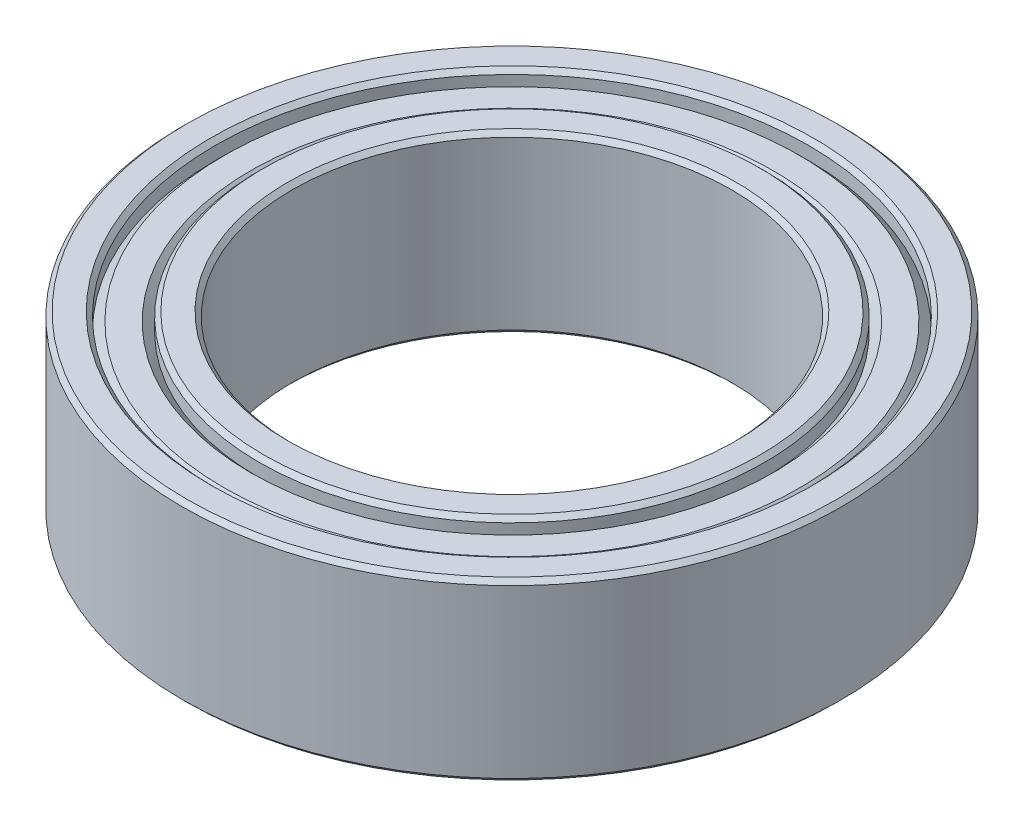
ISO-10303-21;
HEADER;
FILE_DESCRIPTION(('STEP AP214'),'2;1');
FILE_NAME('part.step','',(''),(''),'','','');
FILE_SCHEMA(('AUTOMOTIVE_DESIGN { 1 0 10303 214 1 1 1 1 }'));
ENDSEC;
DATA;
#1=APPLICATION_CONTEXT('core data for automotive mechanical design processes');
#2=APPLICATION_PROTOCOL_DEFINITION('international standard','automotive_design',2000,#1);
#3=PRODUCT_CONTEXT('',#1,'mechanical');
#4=PRODUCT('Part','Part','',(#3));
#5=PRODUCT_RELATED_PRODUCT_CATEGORY('part','',(#4));
#6=PRODUCT_DEFINITION_FORMATION('','',#4);
#7=PRODUCT_DEFINITION_CONTEXT('part definition',#1,'design');
#8=PRODUCT_DEFINITION('design','',#6,#7);
#9=PRODUCT_DEFINITION_SHAPE('','',#8);
#10=(LENGTH_UNIT() NAMED_UNIT(*) SI_UNIT(.MILLI.,.METRE.));
#11=(NAMED_UNIT(*) PLANE_ANGLE_UNIT() SI_UNIT($,.RADIAN.));
#12=(NAMED_UNIT(*) SI_UNIT($,.STERADIAN.) SOLID_ANGLE_UNIT());
#13=UNCERTAINTY_MEASURE_WITH_UNIT(LENGTH_MEASURE(1.E-05),#10,'distance_accuracy_value','');
#14=(GEOMETRIC_REPRESENTATION_CONTEXT(3) GLOBAL_UNCERTAINTY_ASSIGNED_CONTEXT((#13)) GLOBAL_UNIT_ASSIGNED_CONTEXT((#10,
#11,#12)) REPRESENTATION_CONTEXT('',''));
#15=CARTESIAN_POINT('',(0.,0.,0.));
#16=DIRECTION('',(0.,0.,1.));
#17=DIRECTION('',(1.,0.,0.));
#18=AXIS2_PLACEMENT_3D('',#15,#16,#17);
#19=CARTESIAN_POINT('',(0.,-2.,0.));
#20=DIRECTION('',(0.,1.,0.));
#21=DIRECTION('',(0.,0.,1.));
#22=AXIS2_PLACEMENT_3D('',#19,#20,#21);
#23=PLANE('',#22);
#24=CARTESIAN_POINT('',(0.,-2.,0.));
#25=DIRECTION('',(0.,1.,0.));
#26=DIRECTION('',(0.,0.,1.));
#27=AXIS2_PLACEMENT_3D('',#24,#25,#26);
#28=CIRCLE('',#27,6.85);
#29=CARTESIAN_POINT('',(0.,-2.,6.85));
#30=VERTEX_POINT('',#29);
#31=EDGE_CURVE('E61',#30,#30,#28,.T.);
#32=ORIENTED_EDGE('',*,*,#31,.T.);
#33=EDGE_LOOP('',(#32));
#34=FACE_BOUND('',#33,.T.);
#35=CARTESIAN_POINT('',(0.,-2.,0.));
#36=DIRECTION('',(0.,1.,0.));
#37=DIRECTION('',(0.,0.,1.));
#38=AXIS2_PLACEMENT_3D('',#35,#36,#37);
#39=CIRCLE('',#38,7.4);
#40=CARTESIAN_POINT('',(0.,-2.,7.4));
#41=VERTEX_POINT('',#40);
#42=EDGE_CURVE('E64',#41,#41,#39,.F.);
#43=ORIENTED_EDGE('',*,*,#42,.T.);
#44=EDGE_LOOP('',(#43));
#45=FACE_BOUND('',#44,.T.);
#46=ADVANCED_FACE('F35',(#34,#45),#23,.F.);
#47=CARTESIAN_POINT('',(0.,-2.,0.));
#48=DIRECTION('',(0.,1.,0.));
#49=DIRECTION('',(0.,0.,1.));
#50=AXIS2_PLACEMENT_3D('',#47,#48,#49);
#51=CIRCLE('',#50,5.1);
#52=CARTESIAN_POINT('',(0.,-2.,5.1));
#53=VERTEX_POINT('',#52);
#54=EDGE_CURVE('E85',#53,#53,#51,.T.);
#55=ORIENTED_EDGE('',*,*,#54,.T.);
#56=EDGE_LOOP('',(#55));
#57=FACE_BOUND('',#56,.T.);
#58=CARTESIAN_POINT('',(0.,-2.,0.));
#59=DIRECTION('',(0.,1.,0.));
#60=DIRECTION('',(0.,0.,1.));
#61=AXIS2_PLACEMENT_3D('',#58,#59,#60);
#62=CIRCLE('',#61,5.64999999999999);
#63=CARTESIAN_POINT('',(0.,-2.,5.64999999999999));
#64=VERTEX_POINT('',#63);
#65=EDGE_CURVE('E88',#64,#64,#62,.F.);
#66=ORIENTED_EDGE('',*,*,#65,.T.);
#67=EDGE_LOOP('',(#66));
#68=FACE_BOUND('',#67,.T.);
#69=ADVANCED_FACE('F142',(#57,#68),#23,.F.);
#70=CARTESIAN_POINT('',(0.,2.,0.));
#71=DIRECTION('',(0.,1.,0.));
#72=DIRECTION('',(0.,0.,1.));
#73=AXIS2_PLACEMENT_3D('',#70,#71,#72);
#74=PLANE('',#73);
#75=CARTESIAN_POINT('',(0.,2.,0.));
#76=DIRECTION('',(0.,1.,0.));
#77=DIRECTION('',(0.,0.,1.));
#78=AXIS2_PLACEMENT_3D('',#75,#76,#77);
#79=CIRCLE('',#78,6.85);
#80=CARTESIAN_POINT('',(0.,2.,6.85));
#81=VERTEX_POINT('',#80);
#82=EDGE_CURVE('E46',#81,#81,#79,.F.);
#83=ORIENTED_EDGE('',*,*,#82,.T.);
#84=EDGE_LOOP('',(#83));
#85=FACE_BOUND('',#84,.T.);
#86=CARTESIAN_POINT('',(0.,2.,0.));
#87=DIRECTION('',(0.,1.,0.));
#88=DIRECTION('',(0.,0.,1.));
#89=AXIS2_PLACEMENT_3D('',#86,#87,#88);
#90=CIRCLE('',#89,7.4);
#91=CARTESIAN_POINT('',(0.,2.,7.4));
#92=VERTEX_POINT('',#91);
#93=EDGE_CURVE('E50',#92,#92,#90,.T.);
#94=ORIENTED_EDGE('',*,*,#93,.T.);
#95=EDGE_LOOP('',(#94));
#96=FACE_BOUND('',#95,.T.);
#97=ADVANCED_FACE('F148',(#85,#96),#74,.T.);
#98=CARTESIAN_POINT('',(0.,2.,0.));
#99=DIRECTION('',(0.,1.,0.));
#100=DIRECTION('',(0.,0.,1.));
#101=AXIS2_PLACEMENT_3D('',#98,#99,#100);
#102=CIRCLE('',#101,5.1);
#103=CARTESIAN_POINT('',(0.,2.,5.1));
#104=VERTEX_POINT('',#103);
#105=EDGE_CURVE('E73',#104,#104,#102,.F.);
#106=ORIENTED_EDGE('',*,*,#105,.T.);
#107=EDGE_LOOP('',(#106));
#108=FACE_BOUND('',#107,.T.);
#109=CARTESIAN_POINT('',(0.,2.,0.));
#110=DIRECTION('',(0.,1.,0.));
#111=DIRECTION('',(0.,0.,1.));
#112=AXIS2_PLACEMENT_3D('',#109,#110,#111);
#113=CIRCLE('',#112,5.65);
#114=CARTESIAN_POINT('',(0.,2.,5.65));
#115=VERTEX_POINT('',#114);
#116=EDGE_CURVE('E76',#115,#115,#113,.T.);
#117=ORIENTED_EDGE('',*,*,#116,.T.);
#118=EDGE_LOOP('',(#117));
#119=FACE_BOUND('',#118,.T.);
#120=ADVANCED_FACE('F158',(#108,#119),#74,.T.);
#121=CARTESIAN_POINT('',(0.,2.,0.));
#122=DIRECTION('',(0.,1.,0.));
#123=DIRECTION('',(0.,0.,1.));
#124=AXIS2_PLACEMENT_3D('',#121,#122,#123);
#125=CYLINDRICAL_SURFACE('',#124,5.);
#126=CARTESIAN_POINT('',(0.,-1.9,0.));
#127=DIRECTION('',(0.,1.,0.));
#128=DIRECTION('',(0.,0.,1.));
#129=AXIS2_PLACEMENT_3D('',#126,#127,#128);
#130=CIRCLE('',#129,5.);
#131=CARTESIAN_POINT('',(0.,-1.9,5.));
#132=VERTEX_POINT('',#131);
#133=EDGE_CURVE('E79',#132,#132,#130,.F.);
#134=ORIENTED_EDGE('',*,*,#133,.T.);
#135=EDGE_LOOP('',(#134));
#136=FACE_BOUND('',#135,.T.);
#137=CARTESIAN_POINT('',(0.,1.9,0.));
#138=DIRECTION('',(0.,1.,0.));
#139=DIRECTION('',(0.,0.,1.));
#140=AXIS2_PLACEMENT_3D('',#137,#138,#139);
#141=CIRCLE('',#140,5.);
#142=CARTESIAN_POINT('',(0.,1.9,5.));
#143=VERTEX_POINT('',#142);
#144=EDGE_CURVE('E82',#143,#143,#141,.T.);
#145=ORIENTED_EDGE('',*,*,#144,.T.);
#146=EDGE_LOOP('',(#145));
#147=FACE_BOUND('',#146,.T.);
#148=ADVANCED_FACE('F155',(#136,#147),#125,.F.);
#149=CARTESIAN_POINT('',(0.,2.,0.));
#150=DIRECTION('',(0.,1.,0.));
#151=DIRECTION('',(0.,0.,1.));
#152=AXIS2_PLACEMENT_3D('',#149,#150,#151);
#153=CYLINDRICAL_SURFACE('',#152,7.5);
#154=CARTESIAN_POINT('',(0.,-1.9,0.));
#155=DIRECTION('',(0.,1.,0.));
#156=DIRECTION('',(0.,0.,1.));
#157=AXIS2_PLACEMENT_3D('',#154,#155,#156);
#158=CIRCLE('',#157,7.5);
#159=CARTESIAN_POINT('',(0.,-1.9,7.5));
#160=VERTEX_POINT('',#159);
#161=EDGE_CURVE('E10',#160,#160,#158,.T.);
#162=ORIENTED_EDGE('',*,*,#161,.T.);
#163=EDGE_LOOP('',(#162));
#164=FACE_BOUND('',#163,.T.);
#165=CARTESIAN_POINT('',(0.,1.9,0.));
#166=DIRECTION('',(0.,1.,0.));
#167=DIRECTION('',(0.,0.,1.));
#168=AXIS2_PLACEMENT_3D('',#165,#166,#167);
#169=CIRCLE('',#168,7.5);
#170=CARTESIAN_POINT('',(0.,1.9,7.5));
#171=VERTEX_POINT('',#170);
#172=EDGE_CURVE('E42',#171,#171,#169,.F.);
#173=ORIENTED_EDGE('',*,*,#172,.T.);
#174=EDGE_LOOP('',(#173));
#175=FACE_BOUND('',#174,.T.);
#176=ADVANCED_FACE('F153',(#164,#175),#153,.T.);
#177=CARTESIAN_POINT('',(0.,1.8,0.));
#178=DIRECTION('',(0.,-1.,0.));
#179=DIRECTION('',(0.,0.,-1.));
#180=AXIS2_PLACEMENT_3D('',#177,#178,#179);
#181=CONICAL_SURFACE('',#180,6.55,0.785398163397446);
#182=CARTESIAN_POINT('',(0.,1.6,0.));
#183=DIRECTION('',(0.,1.,0.));
#184=DIRECTION('',(0.,0.,1.));
#185=AXIS2_PLACEMENT_3D('',#182,#183,#184);
#186=CIRCLE('',#185,6.75);
#187=CARTESIAN_POINT('',(0.,1.6,6.75));
#188=VERTEX_POINT('',#187);
#189=EDGE_CURVE('E91',#188,#188,#186,.T.);
#190=ORIENTED_EDGE('',*,*,#189,.T.);
#191=EDGE_LOOP('',(#190));
#192=FACE_BOUND('',#191,.T.);
#193=CARTESIAN_POINT('',(0.,1.8,0.));
#194=DIRECTION('',(0.,1.,0.));
#195=DIRECTION('',(0.,0.,1.));
#196=AXIS2_PLACEMENT_3D('',#193,#194,#195);
#197=CIRCLE('',#196,6.55);
#198=CARTESIAN_POINT('',(0.,1.8,6.55));
#199=VERTEX_POINT('',#198);
#200=EDGE_CURVE('E100',#199,#199,#197,.T.);
#201=ORIENTED_EDGE('',*,*,#200,.F.);
#202=EDGE_LOOP('',(#201));
#203=FACE_BOUND('',#202,.T.);
#204=ADVANCED_FACE('F276',(#192,#203),#181,.T.);
#205=CARTESIAN_POINT('',(0.,2.,0.));
#206=DIRECTION('',(0.,1.,0.));
#207=DIRECTION('',(0.,0.,1.));
#208=AXIS2_PLACEMENT_3D('',#205,#206,#207);
#209=CYLINDRICAL_SURFACE('',#208,6.75);
#210=CARTESIAN_POINT('',(0.,1.9,0.));
#211=DIRECTION('',(0.,1.,0.));
#212=DIRECTION('',(0.,0.,1.));
#213=AXIS2_PLACEMENT_3D('',#210,#211,#212);
#214=CIRCLE('',#213,6.75);
#215=CARTESIAN_POINT('',(0.,1.9,6.75));
#216=VERTEX_POINT('',#215);
#217=EDGE_CURVE('E55',#216,#216,#214,.T.);
#218=ORIENTED_EDGE('',*,*,#217,.T.);
#219=EDGE_LOOP('',(#218));
#220=FACE_BOUND('',#219,.T.);
#221=ORIENTED_EDGE('',*,*,#189,.F.);
#222=EDGE_LOOP('',(#221));
#223=FACE_BOUND('',#222,.T.);
#224=ADVANCED_FACE('F264',(#220,#223),#209,.F.);
#225=CARTESIAN_POINT('',(0.,2.,0.));
#226=DIRECTION('',(0.,1.,0.));
#227=DIRECTION('',(0.,0.,1.));
#228=AXIS2_PLACEMENT_3D('',#225,#226,#227);
#229=CYLINDRICAL_SURFACE('',#228,5.75);
#230=CARTESIAN_POINT('',(0.,1.9,0.));
#231=DIRECTION('',(0.,1.,0.));
#232=DIRECTION('',(0.,0.,1.));
#233=AXIS2_PLACEMENT_3D('',#230,#231,#232);
#234=CIRCLE('',#233,5.75);
#235=CARTESIAN_POINT('',(0.,1.9,5.75));
#236=VERTEX_POINT('',#235);
#237=EDGE_CURVE('E67',#236,#236,#234,.F.);
#238=ORIENTED_EDGE('',*,*,#237,.T.);
#239=EDGE_LOOP('',(#238));
#240=FACE_BOUND('',#239,.T.);
#241=CARTESIAN_POINT('',(0.,1.6,0.));
#242=DIRECTION('',(0.,1.,0.));
#243=DIRECTION('',(0.,0.,1.));
#244=AXIS2_PLACEMENT_3D('',#241,#242,#243);
#245=CIRCLE('',#244,5.75);
#246=CARTESIAN_POINT('',(0.,1.6,5.75));
#247=VERTEX_POINT('',#246);
#248=EDGE_CURVE('E94',#247,#247,#245,.T.);
#249=ORIENTED_EDGE('',*,*,#248,.T.);
#250=EDGE_LOOP('',(#249));
#251=FACE_BOUND('',#250,.T.);
#252=ADVANCED_FACE('F258',(#240,#251),#229,.T.);
#253=CARTESIAN_POINT('',(0.,1.6,0.));
#254=DIRECTION('',(0.,1.,0.));
#255=DIRECTION('',(0.,0.,1.));
#256=AXIS2_PLACEMENT_3D('',#253,#254,#255);
#257=CONICAL_SURFACE('',#256,5.75,0.785398163397445);
#258=CARTESIAN_POINT('',(0.,1.8,0.));
#259=DIRECTION('',(0.,1.,0.));
#260=DIRECTION('',(0.,0.,1.));
#261=AXIS2_PLACEMENT_3D('',#258,#259,#260);
#262=CIRCLE('',#261,5.95);
#263=CARTESIAN_POINT('',(0.,1.8,5.95));
#264=VERTEX_POINT('',#263);
#265=EDGE_CURVE('E97',#264,#264,#262,.T.);
#266=ORIENTED_EDGE('',*,*,#265,.T.);
#267=EDGE_LOOP('',(#266));
#268=FACE_BOUND('',#267,.T.);
#269=ORIENTED_EDGE('',*,*,#248,.F.);
#270=EDGE_LOOP('',(#269));
#271=FACE_BOUND('',#270,.T.);
#272=ADVANCED_FACE('F263',(#268,#271),#257,.F.);
#273=CARTESIAN_POINT('',(0.,1.8,0.));
#274=DIRECTION('',(0.,1.,0.));
#275=DIRECTION('',(0.,0.,1.));
#276=AXIS2_PLACEMENT_3D('',#273,#274,#275);
#277=PLANE('',#276);
#278=ORIENTED_EDGE('',*,*,#200,.T.);
#279=EDGE_LOOP('',(#278));
#280=FACE_BOUND('',#279,.T.);
#281=ORIENTED_EDGE('',*,*,#265,.F.);
#282=EDGE_LOOP('',(#281));
#283=FACE_BOUND('',#282,.T.);
#284=ADVANCED_FACE('F339',(#280,#283),#277,.T.);
#285=CARTESIAN_POINT('',(0.,-1.8,0.));
#286=DIRECTION('',(0.,1.,0.));
#287=DIRECTION('',(0.,0.,-1.));
#288=AXIS2_PLACEMENT_3D('',#285,#286,#287);
#289=CONICAL_SURFACE('',#288,6.55,0.785398163397446);
#290=CARTESIAN_POINT('',(0.,-1.6,0.));
#291=DIRECTION('',(0.,1.,0.));
#292=DIRECTION('',(0.,0.,1.));
#293=AXIS2_PLACEMENT_3D('',#290,#291,#292);
#294=CIRCLE('',#293,6.75);
#295=CARTESIAN_POINT('',(0.,-1.6,6.75));
#296=VERTEX_POINT('',#295);
#297=EDGE_CURVE('E103',#296,#296,#294,.T.);
#298=ORIENTED_EDGE('',*,*,#297,.F.);
#299=EDGE_LOOP('',(#298));
#300=FACE_BOUND('',#299,.T.);
#301=CARTESIAN_POINT('',(0.,-1.8,0.));
#302=DIRECTION('',(0.,1.,0.));
#303=DIRECTION('',(0.,0.,1.));
#304=AXIS2_PLACEMENT_3D('',#301,#302,#303);
#305=CIRCLE('',#304,6.55);
#306=CARTESIAN_POINT('',(0.,-1.8,6.55));
#307=VERTEX_POINT('',#306);
#308=EDGE_CURVE('E112',#307,#307,#305,.T.);
#309=ORIENTED_EDGE('',*,*,#308,.T.);
#310=EDGE_LOOP('',(#309));
#311=FACE_BOUND('',#310,.T.);
#312=ADVANCED_FACE('F116',(#300,#311),#289,.T.);
#313=CARTESIAN_POINT('',(0.,-2.,0.));
#314=DIRECTION('',(0.,-1.,0.));
#315=DIRECTION('',(0.,0.,1.));
#316=AXIS2_PLACEMENT_3D('',#313,#314,#315);
#317=CYLINDRICAL_SURFACE('',#316,6.75);
#318=CARTESIAN_POINT('',(0.,-1.9,0.));
#319=DIRECTION('',(0.,1.,0.));
#320=DIRECTION('',(0.,0.,1.));
#321=AXIS2_PLACEMENT_3D('',#318,#319,#320);
#322=CIRCLE('',#321,6.75);
#323=CARTESIAN_POINT('',(0.,-1.9,6.75));
#324=VERTEX_POINT('',#323);
#325=EDGE_CURVE('E58',#324,#324,#322,.F.);
#326=ORIENTED_EDGE('',*,*,#325,.T.);
#327=EDGE_LOOP('',(#326));
#328=FACE_BOUND('',#327,.T.);
#329=ORIENTED_EDGE('',*,*,#297,.T.);
#330=EDGE_LOOP('',(#329));
#331=FACE_BOUND('',#330,.T.);
#332=ADVANCED_FACE('F133',(#328,#331),#317,.F.);
#333=CARTESIAN_POINT('',(0.,-2.,0.));
#334=DIRECTION('',(0.,-1.,0.));
#335=DIRECTION('',(0.,0.,1.));
#336=AXIS2_PLACEMENT_3D('',#333,#334,#335);
#337=CYLINDRICAL_SURFACE('',#336,5.75);
#338=CARTESIAN_POINT('',(0.,-1.9,0.));
#339=DIRECTION('',(0.,1.,0.));
#340=DIRECTION('',(0.,0.,1.));
#341=AXIS2_PLACEMENT_3D('',#338,#339,#340);
#342=CIRCLE('',#341,5.75);
#343=CARTESIAN_POINT('',(0.,-1.9,5.75));
#344=VERTEX_POINT('',#343);
#345=EDGE_CURVE('E70',#344,#344,#342,.T.);
#346=ORIENTED_EDGE('',*,*,#345,.T.);
#347=EDGE_LOOP('',(#346));
#348=FACE_BOUND('',#347,.T.);
#349=CARTESIAN_POINT('',(0.,-1.6,0.));
#350=DIRECTION('',(0.,1.,0.));
#351=DIRECTION('',(0.,0.,1.));
#352=AXIS2_PLACEMENT_3D('',#349,#350,#351);
#353=CIRCLE('',#352,5.75);
#354=CARTESIAN_POINT('',(0.,-1.6,5.75));
#355=VERTEX_POINT('',#354);
#356=EDGE_CURVE('E106',#355,#355,#353,.T.);
#357=ORIENTED_EDGE('',*,*,#356,.F.);
#358=EDGE_LOOP('',(#357));
#359=FACE_BOUND('',#358,.T.);
#360=ADVANCED_FACE('F128',(#348,#359),#337,.T.);
#361=CARTESIAN_POINT('',(0.,-1.6,0.));
#362=DIRECTION('',(0.,-1.,0.));
#363=DIRECTION('',(0.,0.,1.));
#364=AXIS2_PLACEMENT_3D('',#361,#362,#363);
#365=CONICAL_SURFACE('',#364,5.75,0.785398163397445);
#366=CARTESIAN_POINT('',(0.,-1.8,0.));
#367=DIRECTION('',(0.,1.,0.));
#368=DIRECTION('',(0.,0.,1.));
#369=AXIS2_PLACEMENT_3D('',#366,#367,#368);
#370=CIRCLE('',#369,5.95);
#371=CARTESIAN_POINT('',(0.,-1.8,5.95));
#372=VERTEX_POINT('',#371);
#373=EDGE_CURVE('E109',#372,#372,#370,.T.);
#374=ORIENTED_EDGE('',*,*,#373,.F.);
#375=EDGE_LOOP('',(#374));
#376=FACE_BOUND('',#375,.T.);
#377=ORIENTED_EDGE('',*,*,#356,.T.);
#378=EDGE_LOOP('',(#377));
#379=FACE_BOUND('',#378,.T.);
#380=ADVANCED_FACE('F122',(#376,#379),#365,.F.);
#381=CARTESIAN_POINT('',(0.,-1.8,0.));
#382=DIRECTION('',(0.,-1.,0.));
#383=DIRECTION('',(0.,0.,1.));
#384=AXIS2_PLACEMENT_3D('',#381,#382,#383);
#385=PLANE('',#384);
#386=ORIENTED_EDGE('',*,*,#308,.F.);
#387=EDGE_LOOP('',(#386));
#388=FACE_BOUND('',#387,.T.);
#389=ORIENTED_EDGE('',*,*,#373,.T.);
#390=EDGE_LOOP('',(#389));
#391=FACE_BOUND('',#390,.T.);
#392=ADVANCED_FACE('F118',(#388,#391),#385,.T.);
#393=CARTESIAN_POINT('',(0.,-2.,0.));
#394=DIRECTION('',(0.,-1.,0.));
#395=DIRECTION('',(0.,0.,-1.));
#396=AXIS2_PLACEMENT_3D('',#393,#394,#395);
#397=CONICAL_SURFACE('',#396,5.1,0.78539816339745);
#398=ORIENTED_EDGE('',*,*,#133,.F.);
#399=EDGE_LOOP('',(#398));
#400=FACE_BOUND('',#399,.T.);
#401=ORIENTED_EDGE('',*,*,#54,.F.);
#402=EDGE_LOOP('',(#401));
#403=FACE_BOUND('',#402,.T.);
#404=ADVANCED_FACE('F121',(#400,#403),#397,.F.);
#405=CARTESIAN_POINT('',(0.,1.9,0.));
#406=DIRECTION('',(0.,1.,0.));
#407=DIRECTION('',(0.,0.,1.));
#408=AXIS2_PLACEMENT_3D('',#405,#406,#407);
#409=CONICAL_SURFACE('',#408,5.,0.785398163397461);
#410=ORIENTED_EDGE('',*,*,#105,.F.);
#411=EDGE_LOOP('',(#410));
#412=FACE_BOUND('',#411,.T.);
#413=ORIENTED_EDGE('',*,*,#144,.F.);
#414=EDGE_LOOP('',(#413));
#415=FACE_BOUND('',#414,.T.);
#416=ADVANCED_FACE('F165',(#412,#415),#409,.F.);
#417=CARTESIAN_POINT('',(0.,-1.9,0.));
#418=DIRECTION('',(0.,1.,0.));
#419=DIRECTION('',(0.,0.,1.));
#420=AXIS2_PLACEMENT_3D('',#417,#418,#419);
#421=CONICAL_SURFACE('',#420,5.75,0.785398163397453);
#422=ORIENTED_EDGE('',*,*,#65,.F.);
#423=EDGE_LOOP('',(#422));
#424=FACE_BOUND('',#423,.T.);
#425=ORIENTED_EDGE('',*,*,#345,.F.);
#426=EDGE_LOOP('',(#425));
#427=FACE_BOUND('',#426,.T.);
#428=ADVANCED_FACE('F169',(#424,#427),#421,.T.);
#429=CARTESIAN_POINT('',(0.,2.,0.));
#430=DIRECTION('',(0.,-1.,0.));
#431=DIRECTION('',(0.,0.,-1.));
#432=AXIS2_PLACEMENT_3D('',#429,#430,#431);
#433=CONICAL_SURFACE('',#432,5.65,0.785398163397453);
#434=ORIENTED_EDGE('',*,*,#237,.F.);
#435=EDGE_LOOP('',(#434));
#436=FACE_BOUND('',#435,.T.);
#437=ORIENTED_EDGE('',*,*,#116,.F.);
#438=EDGE_LOOP('',(#437));
#439=FACE_BOUND('',#438,.T.);
#440=ADVANCED_FACE('F173',(#436,#439),#433,.T.);
#441=CARTESIAN_POINT('',(0.,-2.,0.));
#442=DIRECTION('',(0.,-1.,0.));
#443=DIRECTION('',(0.,0.,-1.));
#444=AXIS2_PLACEMENT_3D('',#441,#442,#443);
#445=CONICAL_SURFACE('',#444,6.85,0.785398163397444);
#446=ORIENTED_EDGE('',*,*,#325,.F.);
#447=EDGE_LOOP('',(#446));
#448=FACE_BOUND('',#447,.T.);
#449=ORIENTED_EDGE('',*,*,#31,.F.);
#450=EDGE_LOOP('',(#449));
#451=FACE_BOUND('',#450,.T.);
#452=ADVANCED_FACE('F177',(#448,#451),#445,.F.);
#453=CARTESIAN_POINT('',(0.,1.9,0.));
#454=DIRECTION('',(0.,1.,0.));
#455=DIRECTION('',(0.,0.,1.));
#456=AXIS2_PLACEMENT_3D('',#453,#454,#455);
#457=CONICAL_SURFACE('',#456,6.75,0.785398163397453);
#458=ORIENTED_EDGE('',*,*,#82,.F.);
#459=EDGE_LOOP('',(#458));
#460=FACE_BOUND('',#459,.T.);
#461=ORIENTED_EDGE('',*,*,#217,.F.);
#462=EDGE_LOOP('',(#461));
#463=FACE_BOUND('',#462,.T.);
#464=ADVANCED_FACE('F181',(#460,#463),#457,.F.);
#465=CARTESIAN_POINT('',(0.,-1.9,0.));
#466=DIRECTION('',(0.,1.,0.));
#467=DIRECTION('',(0.,0.,1.));
#468=AXIS2_PLACEMENT_3D('',#465,#466,#467);
#469=CONICAL_SURFACE('',#468,7.5,0.785398163397455);
#470=ORIENTED_EDGE('',*,*,#42,.F.);
#471=EDGE_LOOP('',(#470));
#472=FACE_BOUND('',#471,.T.);
#473=ORIENTED_EDGE('',*,*,#161,.F.);
#474=EDGE_LOOP('',(#473));
#475=FACE_BOUND('',#474,.T.);
#476=ADVANCED_FACE('F184',(#472,#475),#469,.T.);
#477=CARTESIAN_POINT('',(0.,2.,0.));
#478=DIRECTION('',(0.,-1.,0.));
#479=DIRECTION('',(0.,0.,-1.));
#480=AXIS2_PLACEMENT_3D('',#477,#478,#479);
#481=CONICAL_SURFACE('',#480,7.4,0.785398163397448);
#482=ORIENTED_EDGE('',*,*,#172,.F.);
#483=EDGE_LOOP('',(#482));
#484=FACE_BOUND('',#483,.T.);
#485=ORIENTED_EDGE('',*,*,#93,.F.);
#486=EDGE_LOOP('',(#485));
#487=FACE_BOUND('',#486,.T.);
#488=ADVANCED_FACE('F37',(#484,#487),#481,.T.);
#489=CLOSED_SHELL('',(#46,#69,#97,#120,#148,#176,#204,#224,#252,#272,#284,#312,#332,#360,#380,
#392,#404,#416,#428,#440,#452,#464,#476,#488));
#490=MANIFOLD_SOLID_BREP('B2',#489);
#491=ADVANCED_BREP_SHAPE_REPRESENTATION('',(#18,#490),#14);
#492=SHAPE_DEFINITION_REPRESENTATION(#9,#491);
ENDSEC;
END-ISO-10303-21;
